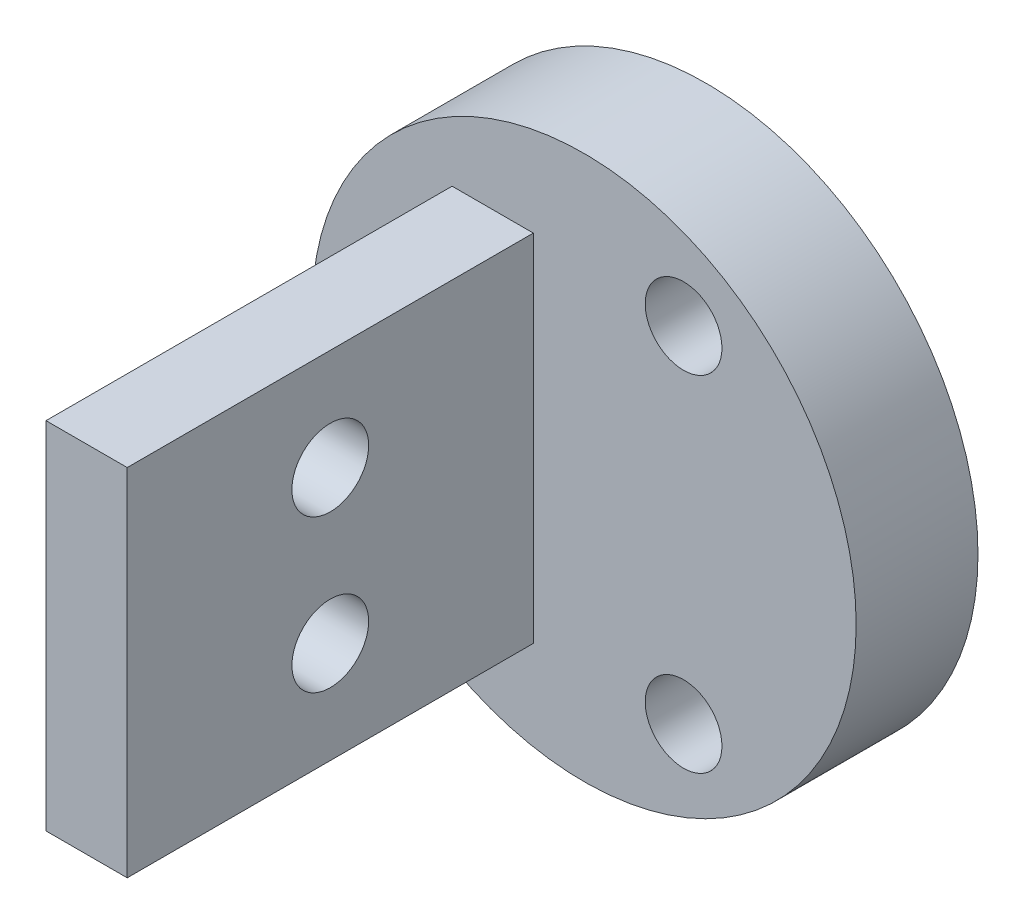
ISO-10303-21;
HEADER;
FILE_DESCRIPTION(('STEP AP214'),'2;1');
FILE_NAME('part.step','',(''),(''),'','','');
FILE_SCHEMA(('AUTOMOTIVE_DESIGN { 1 0 10303 214 1 1 1 1 }'));
ENDSEC;
DATA;
#1=APPLICATION_CONTEXT('core data for automotive mechanical design processes');
#2=APPLICATION_PROTOCOL_DEFINITION('international standard','automotive_design',2000,#1);
#3=PRODUCT_CONTEXT('',#1,'mechanical');
#4=PRODUCT('Part','Part','',(#3));
#5=PRODUCT_RELATED_PRODUCT_CATEGORY('part','',(#4));
#6=PRODUCT_DEFINITION_FORMATION('','',#4);
#7=PRODUCT_DEFINITION_CONTEXT('part definition',#1,'design');
#8=PRODUCT_DEFINITION('design','',#6,#7);
#9=PRODUCT_DEFINITION_SHAPE('','',#8);
#10=(LENGTH_UNIT() NAMED_UNIT(*) SI_UNIT(.MILLI.,.METRE.));
#11=(NAMED_UNIT(*) PLANE_ANGLE_UNIT() SI_UNIT($,.RADIAN.));
#12=(NAMED_UNIT(*) SI_UNIT($,.STERADIAN.) SOLID_ANGLE_UNIT());
#13=UNCERTAINTY_MEASURE_WITH_UNIT(LENGTH_MEASURE(1.E-05),#10,'distance_accuracy_value','');
#14=(GEOMETRIC_REPRESENTATION_CONTEXT(3) GLOBAL_UNCERTAINTY_ASSIGNED_CONTEXT((#13)) GLOBAL_UNIT_ASSIGNED_CONTEXT((#10,
#11,#12)) REPRESENTATION_CONTEXT('',''));
#15=CARTESIAN_POINT('',(0.,0.,0.));
#16=DIRECTION('',(0.,0.,1.));
#17=DIRECTION('',(1.,0.,0.));
#18=AXIS2_PLACEMENT_3D('',#15,#16,#17);
#19=CARTESIAN_POINT('',(0.,0.,3.81));
#20=DIRECTION('',(0.,0.,1.));
#21=DIRECTION('',(1.,0.,0.));
#22=AXIS2_PLACEMENT_3D('',#19,#20,#21);
#23=PLANE('',#22);
#24=CARTESIAN_POINT('',(-6.223,0.,3.81));
#25=DIRECTION('',(0.,0.,1.));
#26=DIRECTION('',(1.,0.,0.));
#27=AXIS2_PLACEMENT_3D('',#24,#25,#26);
#28=CIRCLE('',#27,1.19999999999999);
#29=CARTESIAN_POINT('',(-5.02300000000001,0.,3.81));
#30=VERTEX_POINT('',#29);
#31=EDGE_CURVE('E181',#30,#30,#28,.T.);
#32=ORIENTED_EDGE('',*,*,#31,.F.);
#33=EDGE_LOOP('',(#32));
#34=FACE_BOUND('',#33,.T.);
#35=CARTESIAN_POINT('',(3.11150000000001,5.38927608775055,3.81));
#36=DIRECTION('',(0.,0.,1.));
#37=DIRECTION('',(1.,0.,0.));
#38=AXIS2_PLACEMENT_3D('',#35,#36,#37);
#39=CIRCLE('',#38,1.19999999999999);
#40=CARTESIAN_POINT('',(4.3115,5.38927608775055,3.81));
#41=VERTEX_POINT('',#40);
#42=EDGE_CURVE('E186',#41,#41,#39,.T.);
#43=ORIENTED_EDGE('',*,*,#42,.F.);
#44=EDGE_LOOP('',(#43));
#45=FACE_BOUND('',#44,.T.);
#46=CARTESIAN_POINT('',(3.11149999999999,-5.38927608775058,3.81));
#47=DIRECTION('',(0.,0.,1.));
#48=DIRECTION('',(1.,0.,0.));
#49=AXIS2_PLACEMENT_3D('',#46,#47,#48);
#50=CIRCLE('',#49,1.19999999999999);
#51=CARTESIAN_POINT('',(4.31149999999998,-5.38927608775058,3.81));
#52=VERTEX_POINT('',#51);
#53=EDGE_CURVE('E192',#52,#52,#50,.T.);
#54=ORIENTED_EDGE('',*,*,#53,.F.);
#55=EDGE_LOOP('',(#54));
#56=FACE_BOUND('',#55,.T.);
#57=CARTESIAN_POINT('',(0.,0.,3.81));
#58=DIRECTION('',(0.,0.,1.));
#59=DIRECTION('',(1.,0.,0.));
#60=AXIS2_PLACEMENT_3D('',#57,#58,#59);
#61=CIRCLE('',#60,8.509);
#62=CARTESIAN_POINT('',(8.509,0.,3.81));
#63=VERTEX_POINT('',#62);
#64=EDGE_CURVE('E11',#63,#63,#61,.T.);
#65=ORIENTED_EDGE('',*,*,#64,.T.);
#66=EDGE_LOOP('',(#65));
#67=FACE_BOUND('',#66,.T.);
#68=DIRECTION('',(1.,0.,0.));
#69=VECTOR('',#68,1.);
#70=CARTESIAN_POINT('',(-4.1275,-5.55625,3.81));
#71=LINE('',#70,#69);
#72=CARTESIAN_POINT('',(-4.1275,-5.55625,3.81));
#73=VERTEX_POINT('',#72);
#74=CARTESIAN_POINT('',(-1.5875,-5.55625,3.81));
#75=VERTEX_POINT('',#74);
#76=EDGE_CURVE('E88',#73,#75,#71,.T.);
#77=ORIENTED_EDGE('',*,*,#76,.F.);
#78=DIRECTION('',(0.,-1.,0.));
#79=VECTOR('',#78,1.);
#80=CARTESIAN_POINT('',(-4.1275,5.55625,3.81));
#81=LINE('',#80,#79);
#82=CARTESIAN_POINT('',(-4.1275,5.55625,3.81));
#83=VERTEX_POINT('',#82);
#84=EDGE_CURVE('E99',#83,#73,#81,.T.);
#85=ORIENTED_EDGE('',*,*,#84,.F.);
#86=DIRECTION('',(-1.,0.,0.));
#87=VECTOR('',#86,1.);
#88=CARTESIAN_POINT('',(-4.1275,5.55625,3.81));
#89=LINE('',#88,#87);
#90=CARTESIAN_POINT('',(-1.5875,5.55625,3.81));
#91=VERTEX_POINT('',#90);
#92=EDGE_CURVE('E69',#91,#83,#89,.T.);
#93=ORIENTED_EDGE('',*,*,#92,.F.);
#94=DIRECTION('',(0.,1.,0.));
#95=VECTOR('',#94,1.);
#96=CARTESIAN_POINT('',(-1.5875,5.55625,3.81));
#97=LINE('',#96,#95);
#98=EDGE_CURVE('E104',#75,#91,#97,.T.);
#99=ORIENTED_EDGE('',*,*,#98,.F.);
#100=EDGE_LOOP('',(#77,#85,#93,#99));
#101=FACE_BOUND('',#100,.T.);
#102=ADVANCED_FACE('F32',(#34,#45,#56,#67,#101),#23,.T.);
#103=CARTESIAN_POINT('',(0.,0.,3.81));
#104=DIRECTION('',(0.,0.,-1.));
#105=DIRECTION('',(-1.,0.,0.));
#106=AXIS2_PLACEMENT_3D('',#103,#104,#105);
#107=CYLINDRICAL_SURFACE('',#106,8.509);
#108=ORIENTED_EDGE('',*,*,#64,.F.);
#109=EDGE_LOOP('',(#108));
#110=FACE_BOUND('',#109,.T.);
#111=CARTESIAN_POINT('',(0.,0.,0.));
#112=DIRECTION('',(0.,0.,1.));
#113=DIRECTION('',(1.,0.,0.));
#114=AXIS2_PLACEMENT_3D('',#111,#112,#113);
#115=CIRCLE('',#114,8.509);
#116=CARTESIAN_POINT('',(8.509,0.,0.));
#117=VERTEX_POINT('',#116);
#118=EDGE_CURVE('E36',#117,#117,#115,.T.);
#119=ORIENTED_EDGE('',*,*,#118,.T.);
#120=EDGE_LOOP('',(#119));
#121=FACE_BOUND('',#120,.T.);
#122=ADVANCED_FACE('F34',(#110,#121),#107,.T.);
#123=CARTESIAN_POINT('',(0.,0.,0.));
#124=DIRECTION('',(0.,0.,1.));
#125=DIRECTION('',(1.,0.,0.));
#126=AXIS2_PLACEMENT_3D('',#123,#124,#125);
#127=PLANE('',#126);
#128=CARTESIAN_POINT('',(-6.223,0.,0.));
#129=DIRECTION('',(0.,0.,1.));
#130=DIRECTION('',(1.,0.,0.));
#131=AXIS2_PLACEMENT_3D('',#128,#129,#130);
#132=CIRCLE('',#131,1.2);
#133=CARTESIAN_POINT('',(-5.023,0.,0.));
#134=VERTEX_POINT('',#133);
#135=EDGE_CURVE('E184',#134,#134,#132,.T.);
#136=ORIENTED_EDGE('',*,*,#135,.T.);
#137=EDGE_LOOP('',(#136));
#138=FACE_BOUND('',#137,.T.);
#139=CARTESIAN_POINT('',(3.11150000000001,5.38927608775055,0.));
#140=DIRECTION('',(0.,0.,1.));
#141=DIRECTION('',(1.,0.,0.));
#142=AXIS2_PLACEMENT_3D('',#139,#140,#141);
#143=CIRCLE('',#142,1.2);
#144=CARTESIAN_POINT('',(4.31150000000001,5.38927608775055,0.));
#145=VERTEX_POINT('',#144);
#146=EDGE_CURVE('E189',#145,#145,#143,.T.);
#147=ORIENTED_EDGE('',*,*,#146,.T.);
#148=EDGE_LOOP('',(#147));
#149=FACE_BOUND('',#148,.T.);
#150=CARTESIAN_POINT('',(3.11149999999999,-5.38927608775058,0.));
#151=DIRECTION('',(0.,0.,1.));
#152=DIRECTION('',(1.,0.,0.));
#153=AXIS2_PLACEMENT_3D('',#150,#151,#152);
#154=CIRCLE('',#153,1.2);
#155=CARTESIAN_POINT('',(4.31149999999999,-5.38927608775058,0.));
#156=VERTEX_POINT('',#155);
#157=EDGE_CURVE('E102',#156,#156,#154,.T.);
#158=ORIENTED_EDGE('',*,*,#157,.T.);
#159=EDGE_LOOP('',(#158));
#160=FACE_BOUND('',#159,.T.);
#161=ORIENTED_EDGE('',*,*,#118,.F.);
#162=EDGE_LOOP('',(#161));
#163=FACE_BOUND('',#162,.T.);
#164=ADVANCED_FACE('F113',(#138,#149,#160,#163),#127,.F.);
#165=CARTESIAN_POINT('',(-4.1275,5.55625,16.51));
#166=DIRECTION('',(1.,0.,0.));
#167=DIRECTION('',(0.,1.,0.));
#168=AXIS2_PLACEMENT_3D('',#165,#166,#167);
#169=PLANE('',#168);
#170=CARTESIAN_POINT('',(-4.1275,-2.38125,10.16));
#171=DIRECTION('',(1.,0.,0.));
#172=DIRECTION('',(0.,1.,0.));
#173=AXIS2_PLACEMENT_3D('',#170,#171,#172);
#174=CIRCLE('',#173,1.19999999999999);
#175=CARTESIAN_POINT('',(-4.1275,-1.18125000000001,10.16));
#176=VERTEX_POINT('',#175);
#177=EDGE_CURVE('E171',#176,#176,#174,.T.);
#178=ORIENTED_EDGE('',*,*,#177,.T.);
#179=EDGE_LOOP('',(#178));
#180=FACE_BOUND('',#179,.T.);
#181=CARTESIAN_POINT('',(-4.1275,2.38125,10.16));
#182=DIRECTION('',(1.,0.,0.));
#183=DIRECTION('',(0.,1.,0.));
#184=AXIS2_PLACEMENT_3D('',#181,#182,#183);
#185=CIRCLE('',#184,1.19999999999999);
#186=CARTESIAN_POINT('',(-4.1275,3.58124999999999,10.16));
#187=VERTEX_POINT('',#186);
#188=EDGE_CURVE('E175',#187,#187,#185,.T.);
#189=ORIENTED_EDGE('',*,*,#188,.T.);
#190=EDGE_LOOP('',(#189));
#191=FACE_BOUND('',#190,.T.);
#192=ORIENTED_EDGE('',*,*,#84,.T.);
#193=DIRECTION('',(0.,0.,-1.));
#194=VECTOR('',#193,1.);
#195=CARTESIAN_POINT('',(-4.1275,-5.55625,16.51));
#196=LINE('',#195,#194);
#197=CARTESIAN_POINT('',(-4.1275,-5.55625,16.51));
#198=VERTEX_POINT('',#197);
#199=EDGE_CURVE('E91',#198,#73,#196,.T.);
#200=ORIENTED_EDGE('',*,*,#199,.F.);
#201=DIRECTION('',(0.,-1.,0.));
#202=VECTOR('',#201,1.);
#203=CARTESIAN_POINT('',(-4.1275,5.55625,16.51));
#204=LINE('',#203,#202);
#205=CARTESIAN_POINT('',(-4.1275,5.55625,16.51));
#206=VERTEX_POINT('',#205);
#207=EDGE_CURVE('E81',#206,#198,#204,.T.);
#208=ORIENTED_EDGE('',*,*,#207,.F.);
#209=DIRECTION('',(0.,0.,-1.));
#210=VECTOR('',#209,1.);
#211=CARTESIAN_POINT('',(-4.1275,5.55625,16.51));
#212=LINE('',#211,#210);
#213=EDGE_CURVE('E95',#206,#83,#212,.T.);
#214=ORIENTED_EDGE('',*,*,#213,.T.);
#215=EDGE_LOOP('',(#192,#200,#208,#214));
#216=FACE_BOUND('',#215,.T.);
#217=ADVANCED_FACE('F115',(#180,#191,#216),#169,.F.);
#218=CARTESIAN_POINT('',(-4.1275,-5.55625,16.51));
#219=DIRECTION('',(0.,1.,0.));
#220=DIRECTION('',(0.,0.,1.));
#221=AXIS2_PLACEMENT_3D('',#218,#219,#220);
#222=PLANE('',#221);
#223=ORIENTED_EDGE('',*,*,#76,.T.);
#224=DIRECTION('',(0.,0.,-1.));
#225=VECTOR('',#224,1.);
#226=CARTESIAN_POINT('',(-1.5875,-5.55625,16.51));
#227=LINE('',#226,#225);
#228=CARTESIAN_POINT('',(-1.5875,-5.55625,16.51));
#229=VERTEX_POINT('',#228);
#230=EDGE_CURVE('E85',#229,#75,#227,.T.);
#231=ORIENTED_EDGE('',*,*,#230,.F.);
#232=DIRECTION('',(1.,0.,0.));
#233=VECTOR('',#232,1.);
#234=CARTESIAN_POINT('',(-4.1275,-5.55625,16.51));
#235=LINE('',#234,#233);
#236=EDGE_CURVE('E76',#198,#229,#235,.T.);
#237=ORIENTED_EDGE('',*,*,#236,.F.);
#238=ORIENTED_EDGE('',*,*,#199,.T.);
#239=EDGE_LOOP('',(#223,#231,#237,#238));
#240=FACE_BOUND('',#239,.T.);
#241=ADVANCED_FACE('F86',(#240),#222,.F.);
#242=CARTESIAN_POINT('',(-1.5875,5.55625,16.51));
#243=DIRECTION('',(-1.,0.,0.));
#244=DIRECTION('',(0.,-1.,0.));
#245=AXIS2_PLACEMENT_3D('',#242,#243,#244);
#246=PLANE('',#245);
#247=CARTESIAN_POINT('',(-1.5875,-2.38125,10.16));
#248=DIRECTION('',(1.,0.,0.));
#249=DIRECTION('',(0.,0.,-1.));
#250=AXIS2_PLACEMENT_3D('',#247,#248,#249);
#251=CIRCLE('',#250,1.19999999999999);
#252=CARTESIAN_POINT('',(-1.5875,-2.38125,8.96000000000001));
#253=VERTEX_POINT('',#252);
#254=EDGE_CURVE('E168',#253,#253,#251,.T.);
#255=ORIENTED_EDGE('',*,*,#254,.F.);
#256=EDGE_LOOP('',(#255));
#257=FACE_BOUND('',#256,.T.);
#258=CARTESIAN_POINT('',(-1.5875,2.38125,10.16));
#259=DIRECTION('',(1.,0.,0.));
#260=DIRECTION('',(0.,0.,-1.));
#261=AXIS2_PLACEMENT_3D('',#258,#259,#260);
#262=CIRCLE('',#261,1.19999999999999);
#263=CARTESIAN_POINT('',(-1.5875,2.38125,8.96000000000001));
#264=VERTEX_POINT('',#263);
#265=EDGE_CURVE('E172',#264,#264,#262,.T.);
#266=ORIENTED_EDGE('',*,*,#265,.F.);
#267=EDGE_LOOP('',(#266));
#268=FACE_BOUND('',#267,.T.);
#269=ORIENTED_EDGE('',*,*,#98,.T.);
#270=DIRECTION('',(0.,0.,-1.));
#271=VECTOR('',#270,1.);
#272=CARTESIAN_POINT('',(-1.5875,5.55625,16.51));
#273=LINE('',#272,#271);
#274=CARTESIAN_POINT('',(-1.5875,5.55625,16.51));
#275=VERTEX_POINT('',#274);
#276=EDGE_CURVE('E47',#275,#91,#273,.T.);
#277=ORIENTED_EDGE('',*,*,#276,.F.);
#278=DIRECTION('',(0.,1.,0.));
#279=VECTOR('',#278,1.);
#280=CARTESIAN_POINT('',(-1.5875,5.55625,16.51));
#281=LINE('',#280,#279);
#282=EDGE_CURVE('E79',#229,#275,#281,.T.);
#283=ORIENTED_EDGE('',*,*,#282,.F.);
#284=ORIENTED_EDGE('',*,*,#230,.T.);
#285=EDGE_LOOP('',(#269,#277,#283,#284));
#286=FACE_BOUND('',#285,.T.);
#287=ADVANCED_FACE('F93',(#257,#268,#286),#246,.F.);
#288=CARTESIAN_POINT('',(-4.1275,5.55625,16.51));
#289=DIRECTION('',(0.,-1.,0.));
#290=DIRECTION('',(0.,0.,-1.));
#291=AXIS2_PLACEMENT_3D('',#288,#289,#290);
#292=PLANE('',#291);
#293=ORIENTED_EDGE('',*,*,#92,.T.);
#294=ORIENTED_EDGE('',*,*,#213,.F.);
#295=DIRECTION('',(-1.,0.,0.));
#296=VECTOR('',#295,1.);
#297=CARTESIAN_POINT('',(-4.1275,5.55625,16.51));
#298=LINE('',#297,#296);
#299=EDGE_CURVE('E55',#275,#206,#298,.T.);
#300=ORIENTED_EDGE('',*,*,#299,.F.);
#301=ORIENTED_EDGE('',*,*,#276,.T.);
#302=EDGE_LOOP('',(#293,#294,#300,#301));
#303=FACE_BOUND('',#302,.T.);
#304=ADVANCED_FACE('F138',(#303),#292,.F.);
#305=CARTESIAN_POINT('',(0.,0.,16.51));
#306=DIRECTION('',(0.,0.,1.));
#307=DIRECTION('',(1.,0.,0.));
#308=AXIS2_PLACEMENT_3D('',#305,#306,#307);
#309=PLANE('',#308);
#310=ORIENTED_EDGE('',*,*,#207,.T.);
#311=ORIENTED_EDGE('',*,*,#236,.T.);
#312=ORIENTED_EDGE('',*,*,#282,.T.);
#313=ORIENTED_EDGE('',*,*,#299,.T.);
#314=EDGE_LOOP('',(#310,#311,#312,#313));
#315=FACE_BOUND('',#314,.T.);
#316=ADVANCED_FACE('F77',(#315),#309,.T.);
#317=CARTESIAN_POINT('',(3.11149999999999,-5.38927608775058,3.81));
#318=DIRECTION('',(0.,0.,1.));
#319=DIRECTION('',(1.,0.,0.));
#320=AXIS2_PLACEMENT_3D('',#317,#318,#319);
#321=CYLINDRICAL_SURFACE('',#320,1.19999999999999);
#322=ORIENTED_EDGE('',*,*,#157,.F.);
#323=EDGE_LOOP('',(#322));
#324=FACE_BOUND('',#323,.T.);
#325=ORIENTED_EDGE('',*,*,#53,.T.);
#326=EDGE_LOOP('',(#325));
#327=FACE_BOUND('',#326,.T.);
#328=ADVANCED_FACE('F144',(#324,#327),#321,.F.);
#329=CARTESIAN_POINT('',(3.11150000000001,5.38927608775055,3.81));
#330=DIRECTION('',(0.,0.,1.));
#331=DIRECTION('',(1.,0.,0.));
#332=AXIS2_PLACEMENT_3D('',#329,#330,#331);
#333=CYLINDRICAL_SURFACE('',#332,1.19999999999999);
#334=ORIENTED_EDGE('',*,*,#146,.F.);
#335=EDGE_LOOP('',(#334));
#336=FACE_BOUND('',#335,.T.);
#337=ORIENTED_EDGE('',*,*,#42,.T.);
#338=EDGE_LOOP('',(#337));
#339=FACE_BOUND('',#338,.T.);
#340=ADVANCED_FACE('F147',(#336,#339),#333,.F.);
#341=CARTESIAN_POINT('',(-6.223,0.,3.81));
#342=DIRECTION('',(0.,0.,1.));
#343=DIRECTION('',(1.,0.,0.));
#344=AXIS2_PLACEMENT_3D('',#341,#342,#343);
#345=CYLINDRICAL_SURFACE('',#344,1.19999999999999);
#346=ORIENTED_EDGE('',*,*,#135,.F.);
#347=EDGE_LOOP('',(#346));
#348=FACE_BOUND('',#347,.T.);
#349=ORIENTED_EDGE('',*,*,#31,.T.);
#350=EDGE_LOOP('',(#349));
#351=FACE_BOUND('',#350,.T.);
#352=ADVANCED_FACE('F151',(#348,#351),#345,.F.);
#353=CARTESIAN_POINT('',(-1.5875,2.38125,10.16));
#354=DIRECTION('',(1.,0.,0.));
#355=DIRECTION('',(0.,0.,-1.));
#356=AXIS2_PLACEMENT_3D('',#353,#354,#355);
#357=CYLINDRICAL_SURFACE('',#356,1.19999999999999);
#358=ORIENTED_EDGE('',*,*,#265,.T.);
#359=EDGE_LOOP('',(#358));
#360=FACE_BOUND('',#359,.T.);
#361=ORIENTED_EDGE('',*,*,#188,.F.);
#362=EDGE_LOOP('',(#361));
#363=FACE_BOUND('',#362,.T.);
#364=ADVANCED_FACE('F155',(#360,#363),#357,.F.);
#365=CARTESIAN_POINT('',(-1.5875,-2.38125,10.16));
#366=DIRECTION('',(1.,0.,0.));
#367=DIRECTION('',(0.,0.,-1.));
#368=AXIS2_PLACEMENT_3D('',#365,#366,#367);
#369=CYLINDRICAL_SURFACE('',#368,1.19999999999999);
#370=ORIENTED_EDGE('',*,*,#254,.T.);
#371=EDGE_LOOP('',(#370));
#372=FACE_BOUND('',#371,.T.);
#373=ORIENTED_EDGE('',*,*,#177,.F.);
#374=EDGE_LOOP('',(#373));
#375=FACE_BOUND('',#374,.T.);
#376=ADVANCED_FACE('F159',(#372,#375),#369,.F.);
#377=CLOSED_SHELL('',(#102,#122,#164,#217,#241,#287,#304,#316,#328,#340,#352,#364,#376));
#378=MANIFOLD_SOLID_BREP('B2',#377);
#379=ADVANCED_BREP_SHAPE_REPRESENTATION('',(#18,#378),#14);
#380=SHAPE_DEFINITION_REPRESENTATION(#9,#379);
ENDSEC;
END-ISO-10303-21;
